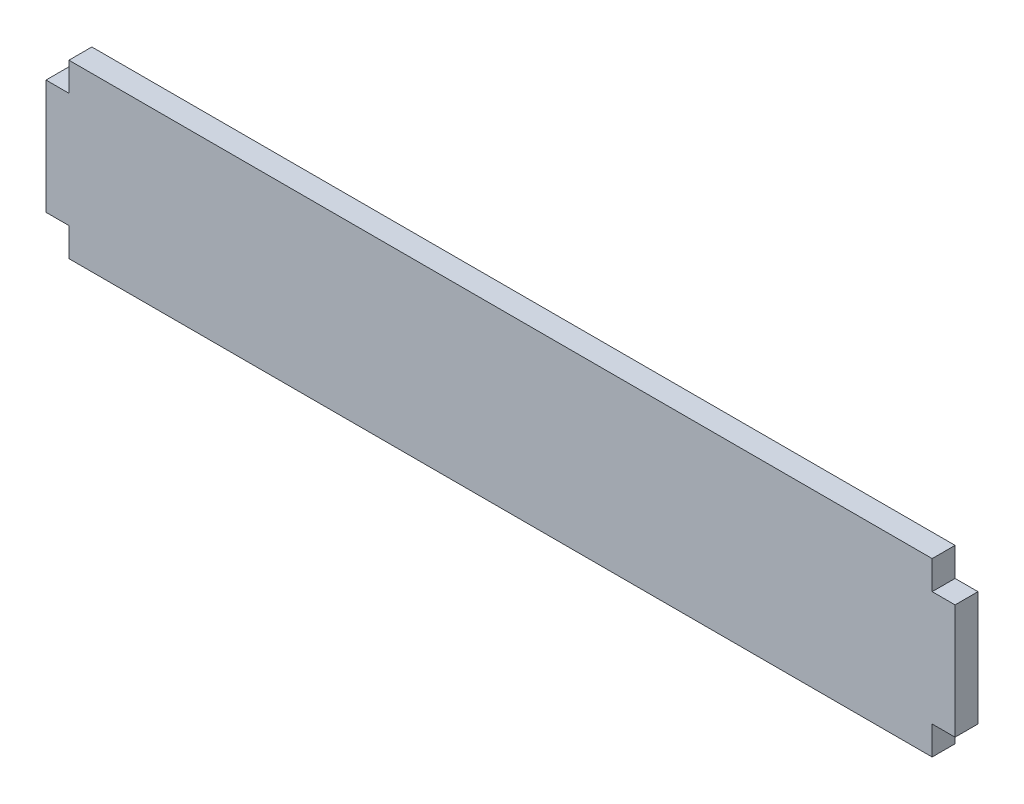
ISO-10303-21;
HEADER;
FILE_DESCRIPTION(('STEP AP214'),'2;1');
FILE_NAME('part.step','',(''),(''),'','','');
FILE_SCHEMA(('AUTOMOTIVE_DESIGN { 1 0 10303 214 1 1 1 1 }'));
ENDSEC;
DATA;
#1=APPLICATION_CONTEXT('core data for automotive mechanical design processes');
#2=APPLICATION_PROTOCOL_DEFINITION('international standard','automotive_design',2000,#1);
#3=PRODUCT_CONTEXT('',#1,'mechanical');
#4=PRODUCT('Part','Part','',(#3));
#5=PRODUCT_RELATED_PRODUCT_CATEGORY('part','',(#4));
#6=PRODUCT_DEFINITION_FORMATION('','',#4);
#7=PRODUCT_DEFINITION_CONTEXT('part definition',#1,'design');
#8=PRODUCT_DEFINITION('design','',#6,#7);
#9=PRODUCT_DEFINITION_SHAPE('','',#8);
#10=(LENGTH_UNIT() NAMED_UNIT(*) SI_UNIT(.MILLI.,.METRE.));
#11=(NAMED_UNIT(*) PLANE_ANGLE_UNIT() SI_UNIT($,.RADIAN.));
#12=(NAMED_UNIT(*) SI_UNIT($,.STERADIAN.) SOLID_ANGLE_UNIT());
#13=UNCERTAINTY_MEASURE_WITH_UNIT(LENGTH_MEASURE(1.E-05),#10,'distance_accuracy_value','');
#14=(GEOMETRIC_REPRESENTATION_CONTEXT(3) GLOBAL_UNCERTAINTY_ASSIGNED_CONTEXT((#13)) GLOBAL_UNIT_ASSIGNED_CONTEXT((#10,
#11,#12)) REPRESENTATION_CONTEXT('',''));
#15=CARTESIAN_POINT('',(0.,0.,0.));
#16=DIRECTION('',(0.,0.,1.));
#17=DIRECTION('',(1.,0.,0.));
#18=AXIS2_PLACEMENT_3D('',#15,#16,#17);
#19=CARTESIAN_POINT('',(113.,-22.5,6.));
#20=DIRECTION('',(-1.,0.,0.));
#21=DIRECTION('',(0.,0.,1.));
#22=AXIS2_PLACEMENT_3D('',#19,#20,#21);
#23=PLANE('',#22);
#24=DIRECTION('',(0.,1.,0.));
#25=VECTOR('',#24,1.);
#26=CARTESIAN_POINT('',(113.,-22.5,0.));
#27=LINE('',#26,#25);
#28=CARTESIAN_POINT('',(113.,-22.5,0.));
#29=VERTEX_POINT('',#28);
#30=CARTESIAN_POINT('',(113.,-15.,0.));
#31=VERTEX_POINT('',#30);
#32=EDGE_CURVE('E190',#29,#31,#27,.T.);
#33=ORIENTED_EDGE('',*,*,#32,.T.);
#34=DIRECTION('',(0.,0.,1.));
#35=VECTOR('',#34,1.);
#36=CARTESIAN_POINT('',(113.,-15.,6.));
#37=LINE('',#36,#35);
#38=CARTESIAN_POINT('',(113.,-15.,6.));
#39=VERTEX_POINT('',#38);
#40=EDGE_CURVE('E175',#31,#39,#37,.T.);
#41=ORIENTED_EDGE('',*,*,#40,.T.);
#42=DIRECTION('',(0.,1.,0.));
#43=VECTOR('',#42,1.);
#44=CARTESIAN_POINT('',(113.,-22.5,6.));
#45=LINE('',#44,#43);
#46=CARTESIAN_POINT('',(113.,-22.5,6.));
#47=VERTEX_POINT('',#46);
#48=EDGE_CURVE('E179',#47,#39,#45,.T.);
#49=ORIENTED_EDGE('',*,*,#48,.F.);
#50=DIRECTION('',(0.,0.,-1.));
#51=VECTOR('',#50,1.);
#52=CARTESIAN_POINT('',(113.,-22.5,6.));
#53=LINE('',#52,#51);
#54=EDGE_CURVE('E189',#47,#29,#53,.T.);
#55=ORIENTED_EDGE('',*,*,#54,.T.);
#56=EDGE_LOOP('',(#33,#41,#49,#55));
#57=FACE_BOUND('',#56,.T.);
#58=ADVANCED_FACE('F33',(#57),#23,.F.);
#59=CARTESIAN_POINT('',(-113.,-22.5,6.));
#60=DIRECTION('',(1.,0.,0.));
#61=DIRECTION('',(0.,0.,-1.));
#62=AXIS2_PLACEMENT_3D('',#59,#60,#61);
#63=PLANE('',#62);
#64=DIRECTION('',(0.,-1.,0.));
#65=VECTOR('',#64,1.);
#66=CARTESIAN_POINT('',(-113.,-22.5,6.));
#67=LINE('',#66,#65);
#68=CARTESIAN_POINT('',(-113.,-15.,6.));
#69=VERTEX_POINT('',#68);
#70=CARTESIAN_POINT('',(-113.,-22.5,6.));
#71=VERTEX_POINT('',#70);
#72=EDGE_CURVE('E185',#69,#71,#67,.T.);
#73=ORIENTED_EDGE('',*,*,#72,.F.);
#74=DIRECTION('',(0.,0.,-1.));
#75=VECTOR('',#74,1.);
#76=CARTESIAN_POINT('',(-113.,-15.,6.));
#77=LINE('',#76,#75);
#78=CARTESIAN_POINT('',(-113.,-15.,0.));
#79=VERTEX_POINT('',#78);
#80=EDGE_CURVE('E172',#69,#79,#77,.T.);
#81=ORIENTED_EDGE('',*,*,#80,.T.);
#82=DIRECTION('',(0.,-1.,0.));
#83=VECTOR('',#82,1.);
#84=CARTESIAN_POINT('',(-113.,-22.5,0.));
#85=LINE('',#84,#83);
#86=CARTESIAN_POINT('',(-113.,-22.5,0.));
#87=VERTEX_POINT('',#86);
#88=EDGE_CURVE('E195',#79,#87,#85,.T.);
#89=ORIENTED_EDGE('',*,*,#88,.T.);
#90=DIRECTION('',(0.,0.,-1.));
#91=VECTOR('',#90,1.);
#92=CARTESIAN_POINT('',(-113.,-22.5,6.));
#93=LINE('',#92,#91);
#94=EDGE_CURVE('E203',#71,#87,#93,.T.);
#95=ORIENTED_EDGE('',*,*,#94,.F.);
#96=EDGE_LOOP('',(#73,#81,#89,#95));
#97=FACE_BOUND('',#96,.T.);
#98=ADVANCED_FACE('F222',(#97),#63,.F.);
#99=CARTESIAN_POINT('',(113.,15.,6.));
#100=VERTEX_POINT('',#99);
#101=CARTESIAN_POINT('',(113.,22.5,6.));
#102=VERTEX_POINT('',#101);
#103=EDGE_CURVE('E183',#100,#102,#45,.T.);
#104=ORIENTED_EDGE('',*,*,#103,.F.);
#105=DIRECTION('',(0.,0.,-1.));
#106=VECTOR('',#105,1.);
#107=CARTESIAN_POINT('',(113.,15.,6.));
#108=LINE('',#107,#106);
#109=CARTESIAN_POINT('',(113.,15.,0.));
#110=VERTEX_POINT('',#109);
#111=EDGE_CURVE('E170',#100,#110,#108,.T.);
#112=ORIENTED_EDGE('',*,*,#111,.T.);
#113=CARTESIAN_POINT('',(113.,22.5,0.));
#114=VERTEX_POINT('',#113);
#115=EDGE_CURVE('E178',#110,#114,#27,.T.);
#116=ORIENTED_EDGE('',*,*,#115,.T.);
#117=DIRECTION('',(0.,0.,-1.));
#118=VECTOR('',#117,1.);
#119=CARTESIAN_POINT('',(113.,22.5,6.));
#120=LINE('',#119,#118);
#121=EDGE_CURVE('E11',#102,#114,#120,.T.);
#122=ORIENTED_EDGE('',*,*,#121,.F.);
#123=EDGE_LOOP('',(#104,#112,#116,#122));
#124=FACE_BOUND('',#123,.T.);
#125=ADVANCED_FACE('F35',(#124),#23,.F.);
#126=CARTESIAN_POINT('',(-113.,22.5,6.));
#127=DIRECTION('',(0.,-1.,0.));
#128=DIRECTION('',(0.,0.,-1.));
#129=AXIS2_PLACEMENT_3D('',#126,#127,#128);
#130=PLANE('',#129);
#131=DIRECTION('',(-1.,0.,0.));
#132=VECTOR('',#131,1.);
#133=CARTESIAN_POINT('',(-113.,22.5,0.));
#134=LINE('',#133,#132);
#135=CARTESIAN_POINT('',(-113.,22.5,0.));
#136=VERTEX_POINT('',#135);
#137=EDGE_CURVE('E193',#114,#136,#134,.T.);
#138=ORIENTED_EDGE('',*,*,#137,.T.);
#139=DIRECTION('',(0.,0.,-1.));
#140=VECTOR('',#139,1.);
#141=CARTESIAN_POINT('',(-113.,22.5,6.));
#142=LINE('',#141,#140);
#143=CARTESIAN_POINT('',(-113.,22.5,6.));
#144=VERTEX_POINT('',#143);
#145=EDGE_CURVE('E41',#144,#136,#142,.T.);
#146=ORIENTED_EDGE('',*,*,#145,.F.);
#147=DIRECTION('',(-1.,0.,0.));
#148=VECTOR('',#147,1.);
#149=CARTESIAN_POINT('',(-113.,22.5,6.));
#150=LINE('',#149,#148);
#151=EDGE_CURVE('E182',#102,#144,#150,.T.);
#152=ORIENTED_EDGE('',*,*,#151,.F.);
#153=ORIENTED_EDGE('',*,*,#121,.T.);
#154=EDGE_LOOP('',(#138,#146,#152,#153));
#155=FACE_BOUND('',#154,.T.);
#156=ADVANCED_FACE('F242',(#155),#130,.F.);
#157=CARTESIAN_POINT('',(-113.,15.,0.));
#158=VERTEX_POINT('',#157);
#159=EDGE_CURVE('E196',#136,#158,#85,.T.);
#160=ORIENTED_EDGE('',*,*,#159,.T.);
#161=DIRECTION('',(0.,0.,1.));
#162=VECTOR('',#161,1.);
#163=CARTESIAN_POINT('',(-113.,15.,6.));
#164=LINE('',#163,#162);
#165=CARTESIAN_POINT('',(-113.,15.,6.));
#166=VERTEX_POINT('',#165);
#167=EDGE_CURVE('E161',#158,#166,#164,.T.);
#168=ORIENTED_EDGE('',*,*,#167,.T.);
#169=EDGE_CURVE('E127',#144,#166,#67,.T.);
#170=ORIENTED_EDGE('',*,*,#169,.F.);
#171=ORIENTED_EDGE('',*,*,#145,.T.);
#172=EDGE_LOOP('',(#160,#168,#170,#171));
#173=FACE_BOUND('',#172,.T.);
#174=ADVANCED_FACE('F209',(#173),#63,.F.);
#175=CARTESIAN_POINT('',(-113.,-22.5,6.));
#176=DIRECTION('',(0.,1.,0.));
#177=DIRECTION('',(0.,0.,1.));
#178=AXIS2_PLACEMENT_3D('',#175,#176,#177);
#179=PLANE('',#178);
#180=DIRECTION('',(1.,0.,0.));
#181=VECTOR('',#180,1.);
#182=CARTESIAN_POINT('',(-113.,-22.5,0.));
#183=LINE('',#182,#181);
#184=EDGE_CURVE('E199',#87,#29,#183,.T.);
#185=ORIENTED_EDGE('',*,*,#184,.T.);
#186=ORIENTED_EDGE('',*,*,#54,.F.);
#187=DIRECTION('',(1.,0.,0.));
#188=VECTOR('',#187,1.);
#189=CARTESIAN_POINT('',(-113.,-22.5,6.));
#190=LINE('',#189,#188);
#191=EDGE_CURVE('E187',#71,#47,#190,.T.);
#192=ORIENTED_EDGE('',*,*,#191,.F.);
#193=ORIENTED_EDGE('',*,*,#94,.T.);
#194=EDGE_LOOP('',(#185,#186,#192,#193));
#195=FACE_BOUND('',#194,.T.);
#196=ADVANCED_FACE('F227',(#195),#179,.F.);
#197=CARTESIAN_POINT('',(0.,0.,6.));
#198=DIRECTION('',(0.,0.,-1.));
#199=DIRECTION('',(-1.,0.,0.));
#200=AXIS2_PLACEMENT_3D('',#197,#198,#199);
#201=PLANE('',#200);
#202=ORIENTED_EDGE('',*,*,#169,.T.);
#203=DIRECTION('',(-1.,0.,0.));
#204=VECTOR('',#203,1.);
#205=CARTESIAN_POINT('',(119.,15.,6.));
#206=LINE('',#205,#204);
#207=CARTESIAN_POINT('',(-119.,15.,6.));
#208=VERTEX_POINT('',#207);
#209=EDGE_CURVE('E48',#166,#208,#206,.T.);
#210=ORIENTED_EDGE('',*,*,#209,.T.);
#211=DIRECTION('',(0.,1.,0.));
#212=VECTOR('',#211,1.);
#213=CARTESIAN_POINT('',(-119.,15.,6.));
#214=LINE('',#213,#212);
#215=CARTESIAN_POINT('',(-119.,-15.,6.));
#216=VERTEX_POINT('',#215);
#217=EDGE_CURVE('E125',#216,#208,#214,.T.);
#218=ORIENTED_EDGE('',*,*,#217,.F.);
#219=DIRECTION('',(-1.,0.,0.));
#220=VECTOR('',#219,1.);
#221=CARTESIAN_POINT('',(119.,-15.,6.));
#222=LINE('',#221,#220);
#223=EDGE_CURVE('E162',#69,#216,#222,.T.);
#224=ORIENTED_EDGE('',*,*,#223,.F.);
#225=ORIENTED_EDGE('',*,*,#72,.T.);
#226=ORIENTED_EDGE('',*,*,#191,.T.);
#227=ORIENTED_EDGE('',*,*,#48,.T.);
#228=CARTESIAN_POINT('',(119.,-15.,6.));
#229=VERTEX_POINT('',#228);
#230=EDGE_CURVE('E159',#229,#39,#222,.T.);
#231=ORIENTED_EDGE('',*,*,#230,.F.);
#232=DIRECTION('',(0.,1.,0.));
#233=VECTOR('',#232,1.);
#234=CARTESIAN_POINT('',(119.,15.,6.));
#235=LINE('',#234,#233);
#236=CARTESIAN_POINT('',(119.,15.,6.));
#237=VERTEX_POINT('',#236);
#238=EDGE_CURVE('E149',#229,#237,#235,.T.);
#239=ORIENTED_EDGE('',*,*,#238,.T.);
#240=EDGE_CURVE('E128',#237,#100,#206,.T.);
#241=ORIENTED_EDGE('',*,*,#240,.T.);
#242=ORIENTED_EDGE('',*,*,#103,.T.);
#243=ORIENTED_EDGE('',*,*,#151,.T.);
#244=EDGE_LOOP('',(#202,#210,#218,#224,#225,#226,#227,#231,#239,#241,#242,#243));
#245=FACE_BOUND('',#244,.T.);
#246=ADVANCED_FACE('F122',(#245),#201,.F.);
#247=CARTESIAN_POINT('',(0.,0.,0.));
#248=DIRECTION('',(0.,0.,-1.));
#249=DIRECTION('',(-1.,0.,0.));
#250=AXIS2_PLACEMENT_3D('',#247,#248,#249);
#251=PLANE('',#250);
#252=ORIENTED_EDGE('',*,*,#115,.F.);
#253=DIRECTION('',(-1.,0.,0.));
#254=VECTOR('',#253,1.);
#255=CARTESIAN_POINT('',(119.,15.,0.));
#256=LINE('',#255,#254);
#257=CARTESIAN_POINT('',(119.,15.,0.));
#258=VERTEX_POINT('',#257);
#259=EDGE_CURVE('E56',#258,#110,#256,.T.);
#260=ORIENTED_EDGE('',*,*,#259,.F.);
#261=DIRECTION('',(0.,-1.,0.));
#262=VECTOR('',#261,1.);
#263=CARTESIAN_POINT('',(119.,15.,0.));
#264=LINE('',#263,#262);
#265=CARTESIAN_POINT('',(119.,-15.,0.));
#266=VERTEX_POINT('',#265);
#267=EDGE_CURVE('E154',#258,#266,#264,.T.);
#268=ORIENTED_EDGE('',*,*,#267,.T.);
#269=DIRECTION('',(-1.,0.,0.));
#270=VECTOR('',#269,1.);
#271=CARTESIAN_POINT('',(119.,-15.,0.));
#272=LINE('',#271,#270);
#273=EDGE_CURVE('E163',#266,#31,#272,.T.);
#274=ORIENTED_EDGE('',*,*,#273,.T.);
#275=ORIENTED_EDGE('',*,*,#32,.F.);
#276=ORIENTED_EDGE('',*,*,#184,.F.);
#277=ORIENTED_EDGE('',*,*,#88,.F.);
#278=CARTESIAN_POINT('',(-119.,-15.,0.));
#279=VERTEX_POINT('',#278);
#280=EDGE_CURVE('E166',#79,#279,#272,.T.);
#281=ORIENTED_EDGE('',*,*,#280,.T.);
#282=DIRECTION('',(0.,-1.,0.));
#283=VECTOR('',#282,1.);
#284=CARTESIAN_POINT('',(-119.,15.,0.));
#285=LINE('',#284,#283);
#286=CARTESIAN_POINT('',(-119.,15.,0.));
#287=VERTEX_POINT('',#286);
#288=EDGE_CURVE('E139',#287,#279,#285,.T.);
#289=ORIENTED_EDGE('',*,*,#288,.F.);
#290=EDGE_CURVE('E135',#158,#287,#256,.T.);
#291=ORIENTED_EDGE('',*,*,#290,.F.);
#292=ORIENTED_EDGE('',*,*,#159,.F.);
#293=ORIENTED_EDGE('',*,*,#137,.F.);
#294=EDGE_LOOP('',(#252,#260,#268,#274,#275,#276,#277,#281,#289,#291,#292,#293));
#295=FACE_BOUND('',#294,.T.);
#296=ADVANCED_FACE('F215',(#295),#251,.T.);
#297=CARTESIAN_POINT('',(-119.,0.,0.));
#298=DIRECTION('',(1.,0.,0.));
#299=DIRECTION('',(0.,0.,-1.));
#300=AXIS2_PLACEMENT_3D('',#297,#298,#299);
#301=PLANE('',#300);
#302=ORIENTED_EDGE('',*,*,#217,.T.);
#303=DIRECTION('',(0.,0.,-1.));
#304=VECTOR('',#303,1.);
#305=CARTESIAN_POINT('',(-119.,15.,6.));
#306=LINE('',#305,#304);
#307=EDGE_CURVE('E132',#208,#287,#306,.T.);
#308=ORIENTED_EDGE('',*,*,#307,.T.);
#309=ORIENTED_EDGE('',*,*,#288,.T.);
#310=DIRECTION('',(0.,0.,1.));
#311=VECTOR('',#310,1.);
#312=CARTESIAN_POINT('',(-119.,-15.,6.));
#313=LINE('',#312,#311);
#314=EDGE_CURVE('E144',#279,#216,#313,.T.);
#315=ORIENTED_EDGE('',*,*,#314,.T.);
#316=EDGE_LOOP('',(#302,#308,#309,#315));
#317=FACE_BOUND('',#316,.T.);
#318=ADVANCED_FACE('F142',(#317),#301,.F.);
#319=CARTESIAN_POINT('',(119.,15.,6.));
#320=DIRECTION('',(0.,1.,0.));
#321=DIRECTION('',(0.,0.,1.));
#322=AXIS2_PLACEMENT_3D('',#319,#320,#321);
#323=PLANE('',#322);
#324=ORIENTED_EDGE('',*,*,#167,.F.);
#325=ORIENTED_EDGE('',*,*,#290,.T.);
#326=ORIENTED_EDGE('',*,*,#307,.F.);
#327=ORIENTED_EDGE('',*,*,#209,.F.);
#328=EDGE_LOOP('',(#324,#325,#326,#327));
#329=FACE_BOUND('',#328,.T.);
#330=ADVANCED_FACE('F133',(#329),#323,.T.);
#331=CARTESIAN_POINT('',(119.,-15.,6.));
#332=DIRECTION('',(0.,-1.,0.));
#333=DIRECTION('',(0.,0.,-1.));
#334=AXIS2_PLACEMENT_3D('',#331,#332,#333);
#335=PLANE('',#334);
#336=ORIENTED_EDGE('',*,*,#80,.F.);
#337=ORIENTED_EDGE('',*,*,#223,.T.);
#338=ORIENTED_EDGE('',*,*,#314,.F.);
#339=ORIENTED_EDGE('',*,*,#280,.F.);
#340=EDGE_LOOP('',(#336,#337,#338,#339));
#341=FACE_BOUND('',#340,.T.);
#342=ADVANCED_FACE('F218',(#341),#335,.T.);
#343=ORIENTED_EDGE('',*,*,#40,.F.);
#344=ORIENTED_EDGE('',*,*,#273,.F.);
#345=DIRECTION('',(0.,0.,1.));
#346=VECTOR('',#345,1.);
#347=CARTESIAN_POINT('',(119.,-15.,6.));
#348=LINE('',#347,#346);
#349=EDGE_CURVE('E129',#266,#229,#348,.T.);
#350=ORIENTED_EDGE('',*,*,#349,.T.);
#351=ORIENTED_EDGE('',*,*,#230,.T.);
#352=EDGE_LOOP('',(#343,#344,#350,#351));
#353=FACE_BOUND('',#352,.T.);
#354=ADVANCED_FACE('F233',(#353),#335,.T.);
#355=ORIENTED_EDGE('',*,*,#111,.F.);
#356=ORIENTED_EDGE('',*,*,#240,.F.);
#357=DIRECTION('',(0.,0.,-1.));
#358=VECTOR('',#357,1.);
#359=CARTESIAN_POINT('',(119.,15.,6.));
#360=LINE('',#359,#358);
#361=EDGE_CURVE('E152',#237,#258,#360,.T.);
#362=ORIENTED_EDGE('',*,*,#361,.T.);
#363=ORIENTED_EDGE('',*,*,#259,.T.);
#364=EDGE_LOOP('',(#355,#356,#362,#363));
#365=FACE_BOUND('',#364,.T.);
#366=ADVANCED_FACE('F262',(#365),#323,.T.);
#367=CARTESIAN_POINT('',(119.,0.,0.));
#368=DIRECTION('',(1.,0.,0.));
#369=DIRECTION('',(0.,0.,-1.));
#370=AXIS2_PLACEMENT_3D('',#367,#368,#369);
#371=PLANE('',#370);
#372=ORIENTED_EDGE('',*,*,#238,.F.);
#373=ORIENTED_EDGE('',*,*,#349,.F.);
#374=ORIENTED_EDGE('',*,*,#267,.F.);
#375=ORIENTED_EDGE('',*,*,#361,.F.);
#376=EDGE_LOOP('',(#372,#373,#374,#375));
#377=FACE_BOUND('',#376,.T.);
#378=ADVANCED_FACE('F238',(#377),#371,.T.);
#379=CLOSED_SHELL('',(#58,#98,#125,#156,#174,#196,#246,#296,#318,#330,#342,#354,#366,#378));
#380=MANIFOLD_SOLID_BREP('B2',#379);
#381=ADVANCED_BREP_SHAPE_REPRESENTATION('',(#18,#380),#14);
#382=SHAPE_DEFINITION_REPRESENTATION(#9,#381);
ENDSEC;
END-ISO-10303-21;
